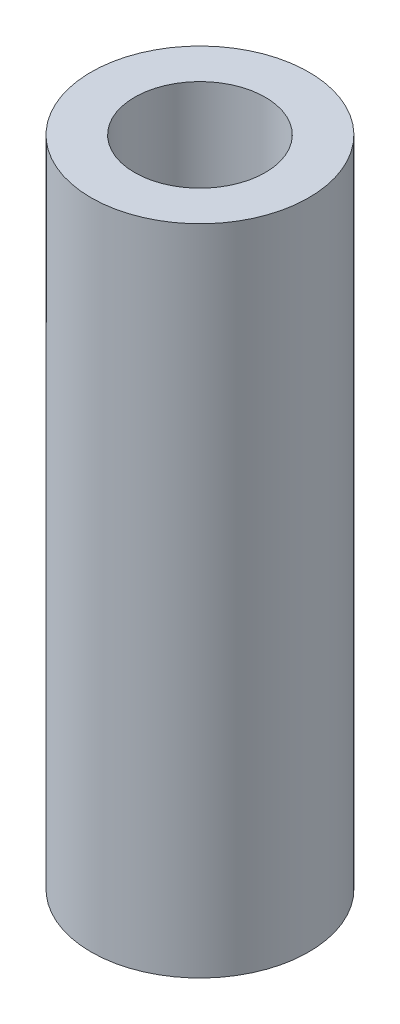
ISO-10303-21;
HEADER;
FILE_DESCRIPTION(('STEP AP214'),'2;1');
FILE_NAME('part.step','',(''),(''),'','','');
FILE_SCHEMA(('AUTOMOTIVE_DESIGN { 1 0 10303 214 1 1 1 1 }'));
ENDSEC;
DATA;
#1=APPLICATION_CONTEXT('core data for automotive mechanical design processes');
#2=APPLICATION_PROTOCOL_DEFINITION('international standard','automotive_design',2000,#1);
#3=PRODUCT_CONTEXT('',#1,'mechanical');
#4=PRODUCT('Part','Part','',(#3));
#5=PRODUCT_RELATED_PRODUCT_CATEGORY('part','',(#4));
#6=PRODUCT_DEFINITION_FORMATION('','',#4);
#7=PRODUCT_DEFINITION_CONTEXT('part definition',#1,'design');
#8=PRODUCT_DEFINITION('design','',#6,#7);
#9=PRODUCT_DEFINITION_SHAPE('','',#8);
#10=(LENGTH_UNIT() NAMED_UNIT(*) SI_UNIT(.MILLI.,.METRE.));
#11=(NAMED_UNIT(*) PLANE_ANGLE_UNIT() SI_UNIT($,.RADIAN.));
#12=(NAMED_UNIT(*) SI_UNIT($,.STERADIAN.) SOLID_ANGLE_UNIT());
#13=UNCERTAINTY_MEASURE_WITH_UNIT(LENGTH_MEASURE(1.E-05),#10,'distance_accuracy_value','');
#14=(GEOMETRIC_REPRESENTATION_CONTEXT(3) GLOBAL_UNCERTAINTY_ASSIGNED_CONTEXT((#13)) GLOBAL_UNIT_ASSIGNED_CONTEXT((#10,
#11,#12)) REPRESENTATION_CONTEXT('',''));
#15=CARTESIAN_POINT('',(0.,0.,0.));
#16=DIRECTION('',(0.,0.,1.));
#17=DIRECTION('',(1.,0.,0.));
#18=AXIS2_PLACEMENT_3D('',#15,#16,#17);
#19=CARTESIAN_POINT('',(0.,6.,0.));
#20=DIRECTION('',(0.,1.,0.));
#21=DIRECTION('',(0.,0.,1.));
#22=AXIS2_PLACEMENT_3D('',#19,#20,#21);
#23=PLANE('',#22);
#24=CARTESIAN_POINT('',(0.,6.,0.));
#25=DIRECTION('',(0.,1.,0.));
#26=DIRECTION('',(0.,0.,1.));
#27=AXIS2_PLACEMENT_3D('',#24,#25,#26);
#28=CIRCLE('',#27,2.);
#29=CARTESIAN_POINT('',(0.,6.,2.));
#30=VERTEX_POINT('',#29);
#31=EDGE_CURVE('E10',#30,#30,#28,.T.);
#32=ORIENTED_EDGE('',*,*,#31,.T.);
#33=EDGE_LOOP('',(#32));
#34=FACE_BOUND('',#33,.T.);
#35=CARTESIAN_POINT('',(0.,6.,0.));
#36=DIRECTION('',(0.,1.,0.));
#37=DIRECTION('',(0.,0.,1.));
#38=AXIS2_PLACEMENT_3D('',#35,#36,#37);
#39=CIRCLE('',#38,1.2);
#40=CARTESIAN_POINT('',(0.,6.,1.2));
#41=VERTEX_POINT('',#40);
#42=EDGE_CURVE('E44',#41,#41,#39,.T.);
#43=ORIENTED_EDGE('',*,*,#42,.F.);
#44=EDGE_LOOP('',(#43));
#45=FACE_BOUND('',#44,.T.);
#46=ADVANCED_FACE('F33',(#34,#45),#23,.T.);
#47=CARTESIAN_POINT('',(0.,-6.,0.));
#48=DIRECTION('',(0.,1.,0.));
#49=DIRECTION('',(0.,0.,1.));
#50=AXIS2_PLACEMENT_3D('',#47,#48,#49);
#51=PLANE('',#50);
#52=CARTESIAN_POINT('',(0.,-6.,0.));
#53=DIRECTION('',(0.,1.,0.));
#54=DIRECTION('',(0.,0.,1.));
#55=AXIS2_PLACEMENT_3D('',#52,#53,#54);
#56=CIRCLE('',#55,2.);
#57=CARTESIAN_POINT('',(0.,-6.,2.));
#58=VERTEX_POINT('',#57);
#59=EDGE_CURVE('E37',#58,#58,#56,.T.);
#60=ORIENTED_EDGE('',*,*,#59,.F.);
#61=EDGE_LOOP('',(#60));
#62=FACE_BOUND('',#61,.T.);
#63=CARTESIAN_POINT('',(0.,-6.,0.));
#64=DIRECTION('',(0.,1.,0.));
#65=DIRECTION('',(0.,0.,1.));
#66=AXIS2_PLACEMENT_3D('',#63,#64,#65);
#67=CIRCLE('',#66,1.2);
#68=CARTESIAN_POINT('',(0.,-6.,1.2));
#69=VERTEX_POINT('',#68);
#70=EDGE_CURVE('E46',#69,#69,#67,.T.);
#71=ORIENTED_EDGE('',*,*,#70,.T.);
#72=EDGE_LOOP('',(#71));
#73=FACE_BOUND('',#72,.T.);
#74=ADVANCED_FACE('F56',(#62,#73),#51,.F.);
#75=CARTESIAN_POINT('',(0.,6.,0.));
#76=DIRECTION('',(0.,-1.,0.));
#77=DIRECTION('',(0.,0.,-1.));
#78=AXIS2_PLACEMENT_3D('',#75,#76,#77);
#79=CYLINDRICAL_SURFACE('',#78,2.);
#80=ORIENTED_EDGE('',*,*,#31,.F.);
#81=EDGE_LOOP('',(#80));
#82=FACE_BOUND('',#81,.T.);
#83=ORIENTED_EDGE('',*,*,#59,.T.);
#84=EDGE_LOOP('',(#83));
#85=FACE_BOUND('',#84,.T.);
#86=ADVANCED_FACE('F35',(#82,#85),#79,.T.);
#87=CARTESIAN_POINT('',(0.,6.,0.));
#88=DIRECTION('',(0.,-1.,0.));
#89=DIRECTION('',(0.,0.,-1.));
#90=AXIS2_PLACEMENT_3D('',#87,#88,#89);
#91=CYLINDRICAL_SURFACE('',#90,1.2);
#92=ORIENTED_EDGE('',*,*,#42,.T.);
#93=EDGE_LOOP('',(#92));
#94=FACE_BOUND('',#93,.T.);
#95=ORIENTED_EDGE('',*,*,#70,.F.);
#96=EDGE_LOOP('',(#95));
#97=FACE_BOUND('',#96,.T.);
#98=ADVANCED_FACE('F52',(#94,#97),#91,.F.);
#99=CLOSED_SHELL('',(#46,#74,#86,#98));
#100=MANIFOLD_SOLID_BREP('B2',#99);
#101=ADVANCED_BREP_SHAPE_REPRESENTATION('',(#18,#100),#14);
#102=SHAPE_DEFINITION_REPRESENTATION(#9,#101);
ENDSEC;
END-ISO-10303-21;
